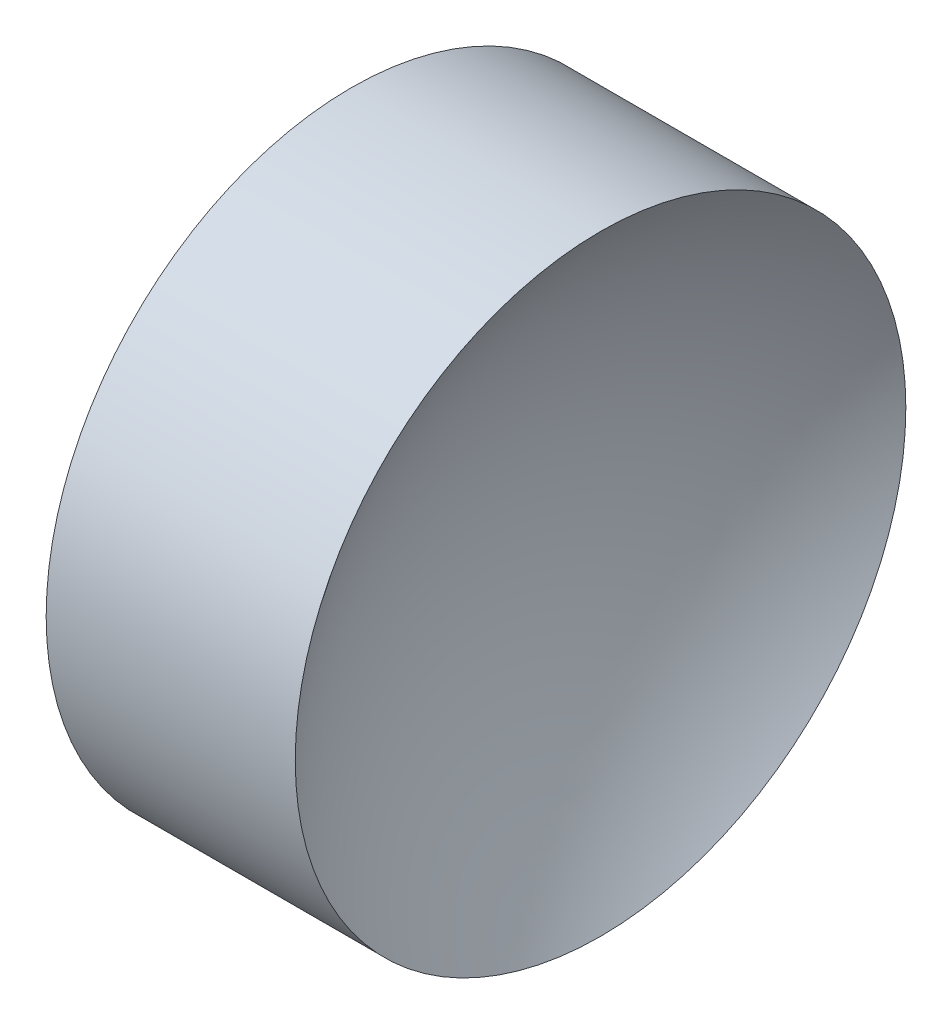
ISO-10303-21;
HEADER;
FILE_DESCRIPTION(('STEP AP214'),'2;1');
FILE_NAME('part.step','',(''),(''),'','','');
FILE_SCHEMA(('AUTOMOTIVE_DESIGN { 1 0 10303 214 1 1 1 1 }'));
ENDSEC;
DATA;
#1=APPLICATION_CONTEXT('core data for automotive mechanical design processes');
#2=APPLICATION_PROTOCOL_DEFINITION('international standard','automotive_design',2000,#1);
#3=PRODUCT_CONTEXT('',#1,'mechanical');
#4=PRODUCT('Part','Part','',(#3));
#5=PRODUCT_RELATED_PRODUCT_CATEGORY('part','',(#4));
#6=PRODUCT_DEFINITION_FORMATION('','',#4);
#7=PRODUCT_DEFINITION_CONTEXT('part definition',#1,'design');
#8=PRODUCT_DEFINITION('design','',#6,#7);
#9=PRODUCT_DEFINITION_SHAPE('','',#8);
#10=(LENGTH_UNIT() NAMED_UNIT(*) SI_UNIT(.MILLI.,.METRE.));
#11=(NAMED_UNIT(*) PLANE_ANGLE_UNIT() SI_UNIT($,.RADIAN.));
#12=(NAMED_UNIT(*) SI_UNIT($,.STERADIAN.) SOLID_ANGLE_UNIT());
#13=UNCERTAINTY_MEASURE_WITH_UNIT(LENGTH_MEASURE(1.E-05),#10,'distance_accuracy_value','');
#14=(GEOMETRIC_REPRESENTATION_CONTEXT(3) GLOBAL_UNCERTAINTY_ASSIGNED_CONTEXT((#13)) GLOBAL_UNIT_ASSIGNED_CONTEXT((#10,
#11,#12)) REPRESENTATION_CONTEXT('',''));
#15=CARTESIAN_POINT('',(0.,0.,0.));
#16=DIRECTION('',(0.,0.,1.));
#17=DIRECTION('',(1.,0.,0.));
#18=AXIS2_PLACEMENT_3D('',#15,#16,#17);
#19=CARTESIAN_POINT('',(28.8438483820032,13.0445205745975,0.));
#20=DIRECTION('',(-1.,0.,0.));
#21=DIRECTION('',(0.,-1.,0.));
#22=AXIS2_PLACEMENT_3D('',#19,#20,#21);
#23=SPHERICAL_SURFACE('',#22,5.17166373498308);
#24=CARTESIAN_POINT('',(24.7421894752023,13.0445205745975,0.));
#25=DIRECTION('',(-1.,0.,0.));
#26=DIRECTION('',(0.,0.,1.));
#27=AXIS2_PLACEMENT_3D('',#24,#25,#26);
#28=CIRCLE('',#27,3.15);
#29=CARTESIAN_POINT('',(24.7421894752023,13.0445205745975,3.15));
#30=VERTEX_POINT('',#29);
#31=EDGE_CURVE('E10',#30,#30,#28,.T.);
#32=ORIENTED_EDGE('',*,*,#31,.F.);
#33=EDGE_LOOP('',(#32));
#34=FACE_BOUND('',#33,.T.);
#35=ADVANCED_FACE('F35',(#34),#23,.F.);
#36=CARTESIAN_POINT('',(21.2249305570684,13.0445205745975,0.));
#37=DIRECTION('',(-1.,0.,0.));
#38=DIRECTION('',(0.,0.,1.));
#39=AXIS2_PLACEMENT_3D('',#36,#37,#38);
#40=CYLINDRICAL_SURFACE('',#39,3.15);
#41=CARTESIAN_POINT('',(22.1721894752023,13.0445205745975,0.));
#42=DIRECTION('',(-1.,0.,0.));
#43=DIRECTION('',(0.,0.,1.));
#44=AXIS2_PLACEMENT_3D('',#41,#42,#43);
#45=CIRCLE('',#44,3.15);
#46=CARTESIAN_POINT('',(22.1721894752023,13.0445205745975,3.15));
#47=VERTEX_POINT('',#46);
#48=EDGE_CURVE('E41',#47,#47,#45,.T.);
#49=ORIENTED_EDGE('',*,*,#48,.F.);
#50=EDGE_LOOP('',(#49));
#51=FACE_BOUND('',#50,.T.);
#52=ORIENTED_EDGE('',*,*,#31,.T.);
#53=EDGE_LOOP('',(#52));
#54=FACE_BOUND('',#53,.T.);
#55=ADVANCED_FACE('F49',(#51,#54),#40,.T.);
#56=CARTESIAN_POINT('',(22.1721894752023,13.0445205745975,0.));
#57=DIRECTION('',(1.,0.,0.));
#58=DIRECTION('',(0.,0.,-1.));
#59=AXIS2_PLACEMENT_3D('',#56,#57,#58);
#60=PLANE('',#59);
#61=ORIENTED_EDGE('',*,*,#48,.T.);
#62=EDGE_LOOP('',(#61));
#63=FACE_BOUND('',#62,.T.);
#64=ADVANCED_FACE('F47',(#63),#60,.F.);
#65=CLOSED_SHELL('',(#35,#55,#64));
#66=MANIFOLD_SOLID_BREP('B2',#65);
#67=ADVANCED_BREP_SHAPE_REPRESENTATION('',(#18,#66),#14);
#68=SHAPE_DEFINITION_REPRESENTATION(#9,#67);
ENDSEC;
END-ISO-10303-21;
